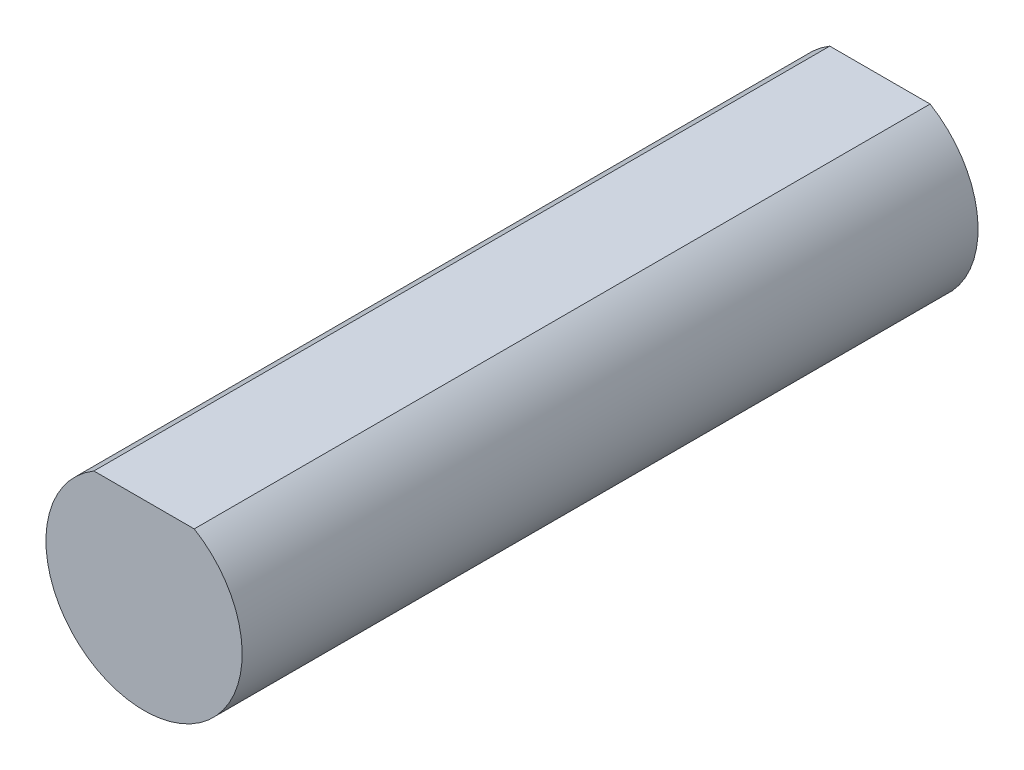
ISO-10303-21;
HEADER;
FILE_DESCRIPTION(('STEP AP214'),'2;1');
FILE_NAME('part.step','',(''),(''),'','','');
FILE_SCHEMA(('AUTOMOTIVE_DESIGN { 1 0 10303 214 1 1 1 1 }'));
ENDSEC;
DATA;
#1=APPLICATION_CONTEXT('core data for automotive mechanical design processes');
#2=APPLICATION_PROTOCOL_DEFINITION('international standard','automotive_design',2000,#1);
#3=PRODUCT_CONTEXT('',#1,'mechanical');
#4=PRODUCT('Part','Part','',(#3));
#5=PRODUCT_RELATED_PRODUCT_CATEGORY('part','',(#4));
#6=PRODUCT_DEFINITION_FORMATION('','',#4);
#7=PRODUCT_DEFINITION_CONTEXT('part definition',#1,'design');
#8=PRODUCT_DEFINITION('design','',#6,#7);
#9=PRODUCT_DEFINITION_SHAPE('','',#8);
#10=(LENGTH_UNIT() NAMED_UNIT(*) SI_UNIT(.MILLI.,.METRE.));
#11=(NAMED_UNIT(*) PLANE_ANGLE_UNIT() SI_UNIT($,.RADIAN.));
#12=(NAMED_UNIT(*) SI_UNIT($,.STERADIAN.) SOLID_ANGLE_UNIT());
#13=UNCERTAINTY_MEASURE_WITH_UNIT(LENGTH_MEASURE(1.E-05),#10,'distance_accuracy_value','');
#14=(GEOMETRIC_REPRESENTATION_CONTEXT(3) GLOBAL_UNCERTAINTY_ASSIGNED_CONTEXT((#13)) GLOBAL_UNIT_ASSIGNED_CONTEXT((#10,
#11,#12)) REPRESENTATION_CONTEXT('',''));
#15=CARTESIAN_POINT('',(0.,0.,0.));
#16=DIRECTION('',(0.,0.,1.));
#17=DIRECTION('',(1.,0.,0.));
#18=AXIS2_PLACEMENT_3D('',#15,#16,#17);
#19=CARTESIAN_POINT('',(0.,0.,15.));
#20=DIRECTION('',(0.,0.,-1.));
#21=DIRECTION('',(-1.,0.,0.));
#22=AXIS2_PLACEMENT_3D('',#19,#20,#21);
#23=CYLINDRICAL_SURFACE('',#22,2.);
#24=CARTESIAN_POINT('',(0.,0.,0.));
#25=DIRECTION('',(0.,0.,1.));
#26=DIRECTION('',(1.,0.,0.));
#27=AXIS2_PLACEMENT_3D('',#24,#25,#26);
#28=CIRCLE('',#27,2.);
#29=CARTESIAN_POINT('',(-1.02266553480157,1.71876560470852,0.));
#30=VERTEX_POINT('',#29);
#31=CARTESIAN_POINT('',(1.02266553480157,1.71876560470852,0.));
#32=VERTEX_POINT('',#31);
#33=EDGE_CURVE('E71',#30,#32,#28,.T.);
#34=ORIENTED_EDGE('',*,*,#33,.T.);
#35=DIRECTION('',(0.,0.,-1.));
#36=VECTOR('',#35,1.);
#37=CARTESIAN_POINT('',(1.02266553480157,1.71876560470852,15.));
#38=LINE('',#37,#36);
#39=CARTESIAN_POINT('',(1.02266553480157,1.71876560470852,15.));
#40=VERTEX_POINT('',#39);
#41=EDGE_CURVE('E11',#40,#32,#38,.T.);
#42=ORIENTED_EDGE('',*,*,#41,.F.);
#43=CARTESIAN_POINT('',(0.,0.,15.));
#44=DIRECTION('',(0.,0.,1.));
#45=DIRECTION('',(1.,0.,0.));
#46=AXIS2_PLACEMENT_3D('',#43,#44,#45);
#47=CIRCLE('',#46,2.);
#48=CARTESIAN_POINT('',(-1.02266553480157,1.71876560470852,15.));
#49=VERTEX_POINT('',#48);
#50=EDGE_CURVE('E70',#49,#40,#47,.T.);
#51=ORIENTED_EDGE('',*,*,#50,.F.);
#52=DIRECTION('',(0.,0.,-1.));
#53=VECTOR('',#52,1.);
#54=CARTESIAN_POINT('',(-1.02266553480157,1.71876560470852,15.));
#55=LINE('',#54,#53);
#56=EDGE_CURVE('E47',#49,#30,#55,.T.);
#57=ORIENTED_EDGE('',*,*,#56,.T.);
#58=EDGE_LOOP('',(#34,#42,#51,#57));
#59=FACE_BOUND('',#58,.T.);
#60=ADVANCED_FACE('F38',(#59),#23,.T.);
#61=CARTESIAN_POINT('',(-1.02266553480157,1.71876560470852,15.));
#62=DIRECTION('',(0.,-1.,0.));
#63=DIRECTION('',(0.,0.,-1.));
#64=AXIS2_PLACEMENT_3D('',#61,#62,#63);
#65=PLANE('',#64);
#66=DIRECTION('',(-1.,0.,0.));
#67=VECTOR('',#66,1.);
#68=CARTESIAN_POINT('',(-1.02266553480157,1.71876560470852,0.));
#69=LINE('',#68,#67);
#70=EDGE_CURVE('E62',#32,#30,#69,.T.);
#71=ORIENTED_EDGE('',*,*,#70,.T.);
#72=ORIENTED_EDGE('',*,*,#56,.F.);
#73=DIRECTION('',(-1.,0.,0.));
#74=VECTOR('',#73,1.);
#75=CARTESIAN_POINT('',(-1.02266553480157,1.71876560470852,15.));
#76=LINE('',#75,#74);
#77=EDGE_CURVE('E54',#40,#49,#76,.T.);
#78=ORIENTED_EDGE('',*,*,#77,.F.);
#79=ORIENTED_EDGE('',*,*,#41,.T.);
#80=EDGE_LOOP('',(#71,#72,#78,#79));
#81=FACE_BOUND('',#80,.T.);
#82=ADVANCED_FACE('F65',(#81),#65,.F.);
#83=CARTESIAN_POINT('',(0.,0.,15.));
#84=DIRECTION('',(0.,0.,1.));
#85=DIRECTION('',(1.,0.,0.));
#86=AXIS2_PLACEMENT_3D('',#83,#84,#85);
#87=PLANE('',#86);
#88=ORIENTED_EDGE('',*,*,#50,.T.);
#89=ORIENTED_EDGE('',*,*,#77,.T.);
#90=EDGE_LOOP('',(#88,#89));
#91=FACE_BOUND('',#90,.T.);
#92=ADVANCED_FACE('F82',(#91),#87,.T.);
#93=CARTESIAN_POINT('',(0.,0.,0.));
#94=DIRECTION('',(0.,0.,1.));
#95=DIRECTION('',(1.,0.,0.));
#96=AXIS2_PLACEMENT_3D('',#93,#94,#95);
#97=PLANE('',#96);
#98=ORIENTED_EDGE('',*,*,#33,.F.);
#99=ORIENTED_EDGE('',*,*,#70,.F.);
#100=EDGE_LOOP('',(#98,#99));
#101=FACE_BOUND('',#100,.T.);
#102=ADVANCED_FACE('F75',(#101),#97,.F.);
#103=CLOSED_SHELL('',(#60,#82,#92,#102));
#104=MANIFOLD_SOLID_BREP('B2',#103);
#105=ADVANCED_BREP_SHAPE_REPRESENTATION('',(#18,#104),#14);
#106=SHAPE_DEFINITION_REPRESENTATION(#9,#105);
ENDSEC;
END-ISO-10303-21;
